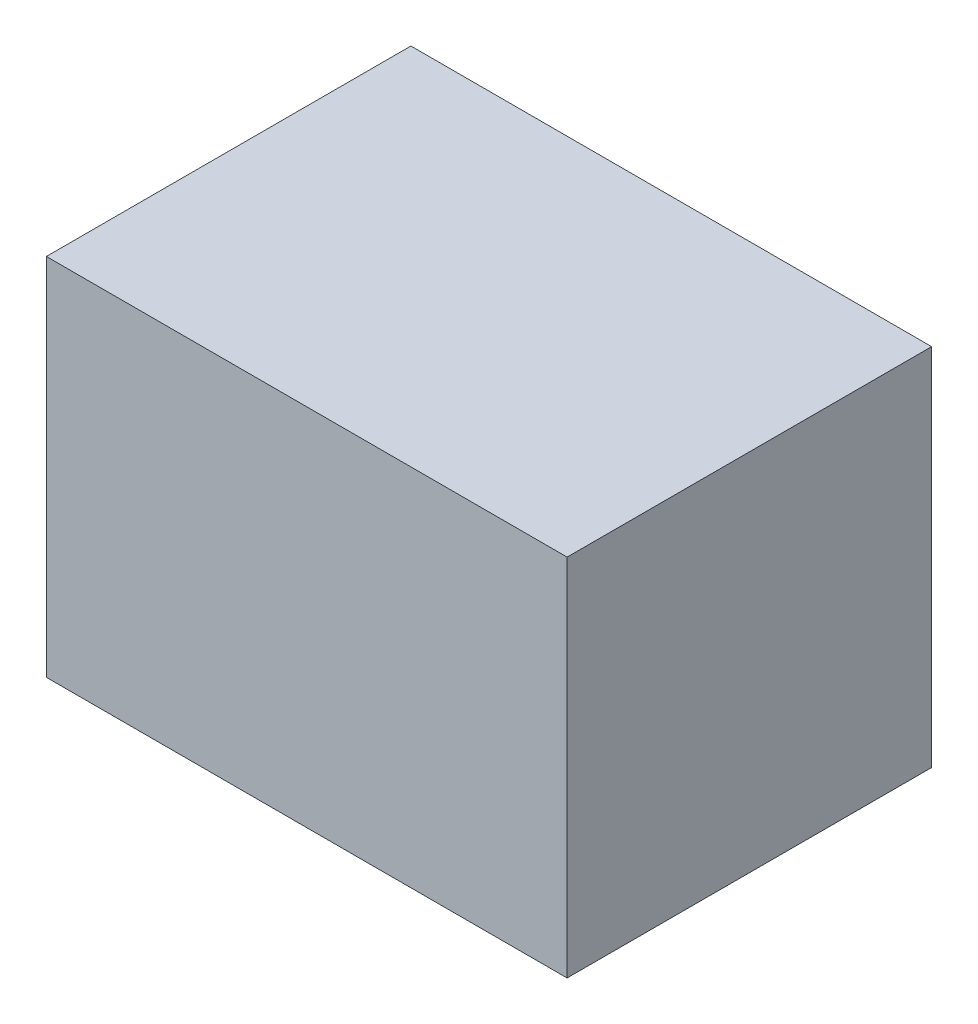
ISO-10303-21;
HEADER;
FILE_DESCRIPTION(('STEP AP214'),'2;1');
FILE_NAME('part.step','',(''),(''),'','','');
FILE_SCHEMA(('AUTOMOTIVE_DESIGN { 1 0 10303 214 1 1 1 1 }'));
ENDSEC;
DATA;
#1=APPLICATION_CONTEXT('core data for automotive mechanical design processes');
#2=APPLICATION_PROTOCOL_DEFINITION('international standard','automotive_design',2000,#1);
#3=PRODUCT_CONTEXT('',#1,'mechanical');
#4=PRODUCT('Part','Part','',(#3));
#5=PRODUCT_RELATED_PRODUCT_CATEGORY('part','',(#4));
#6=PRODUCT_DEFINITION_FORMATION('','',#4);
#7=PRODUCT_DEFINITION_CONTEXT('part definition',#1,'design');
#8=PRODUCT_DEFINITION('design','',#6,#7);
#9=PRODUCT_DEFINITION_SHAPE('','',#8);
#10=(LENGTH_UNIT() NAMED_UNIT(*) SI_UNIT(.MILLI.,.METRE.));
#11=(NAMED_UNIT(*) PLANE_ANGLE_UNIT() SI_UNIT($,.RADIAN.));
#12=(NAMED_UNIT(*) SI_UNIT($,.STERADIAN.) SOLID_ANGLE_UNIT());
#13=UNCERTAINTY_MEASURE_WITH_UNIT(LENGTH_MEASURE(1.E-05),#10,'distance_accuracy_value','');
#14=(GEOMETRIC_REPRESENTATION_CONTEXT(3) GLOBAL_UNCERTAINTY_ASSIGNED_CONTEXT((#13)) GLOBAL_UNIT_ASSIGNED_CONTEXT((#10,
#11,#12)) REPRESENTATION_CONTEXT('',''));
#15=CARTESIAN_POINT('',(0.,0.,0.));
#16=DIRECTION('',(0.,0.,1.));
#17=DIRECTION('',(1.,0.,0.));
#18=AXIS2_PLACEMENT_3D('',#15,#16,#17);
#19=CARTESIAN_POINT('',(-15.24,0.,0.));
#20=DIRECTION('',(0.,-1.,0.));
#21=DIRECTION('',(0.,0.,-1.));
#22=AXIS2_PLACEMENT_3D('',#19,#20,#21);
#23=PLANE('',#22);
#24=DIRECTION('',(1.,0.,0.));
#25=VECTOR('',#24,1.);
#26=CARTESIAN_POINT('',(-15.24,0.,-1.1));
#27=LINE('',#26,#25);
#28=CARTESIAN_POINT('',(-0.25,0.,-1.1));
#29=VERTEX_POINT('',#28);
#30=CARTESIAN_POINT('',(0.25,0.,-1.1));
#31=VERTEX_POINT('',#30);
#32=EDGE_CURVE('E96',#29,#31,#27,.T.);
#33=ORIENTED_EDGE('',*,*,#32,.F.);
#34=DIRECTION('',(0.,0.,1.));
#35=VECTOR('',#34,1.);
#36=CARTESIAN_POINT('',(-0.25,0.,0.));
#37=LINE('',#36,#35);
#38=CARTESIAN_POINT('',(-0.25,0.,-0.75));
#39=VERTEX_POINT('',#38);
#40=EDGE_CURVE('E27',#29,#39,#37,.T.);
#41=ORIENTED_EDGE('',*,*,#40,.T.);
#42=DIRECTION('',(1.,0.,0.));
#43=VECTOR('',#42,1.);
#44=CARTESIAN_POINT('',(-15.24,0.,-0.75));
#45=LINE('',#44,#43);
#46=CARTESIAN_POINT('',(0.25,0.,-0.75));
#47=VERTEX_POINT('',#46);
#48=EDGE_CURVE('E86',#39,#47,#45,.T.);
#49=ORIENTED_EDGE('',*,*,#48,.T.);
#50=DIRECTION('',(0.,0.,1.));
#51=VECTOR('',#50,1.);
#52=CARTESIAN_POINT('',(0.25,0.,0.));
#53=LINE('',#52,#51);
#54=EDGE_CURVE('E107',#31,#47,#53,.T.);
#55=ORIENTED_EDGE('',*,*,#54,.F.);
#56=EDGE_LOOP('',(#33,#41,#49,#55));
#57=FACE_BOUND('',#56,.T.);
#58=ADVANCED_FACE('F17',(#57),#23,.F.);
#59=CARTESIAN_POINT('',(-15.24,-0.35,0.));
#60=DIRECTION('',(0.,-1.,0.));
#61=DIRECTION('',(0.,0.,-1.));
#62=AXIS2_PLACEMENT_3D('',#59,#60,#61);
#63=PLANE('',#62);
#64=DIRECTION('',(1.,0.,0.));
#65=VECTOR('',#64,1.);
#66=CARTESIAN_POINT('',(-15.24,-0.35,-1.1));
#67=LINE('',#66,#65);
#68=CARTESIAN_POINT('',(-0.25,-0.35,-1.1));
#69=VERTEX_POINT('',#68);
#70=CARTESIAN_POINT('',(0.25,-0.35,-1.1));
#71=VERTEX_POINT('',#70);
#72=EDGE_CURVE('E89',#69,#71,#67,.T.);
#73=ORIENTED_EDGE('',*,*,#72,.T.);
#74=DIRECTION('',(0.,0.,1.));
#75=VECTOR('',#74,1.);
#76=CARTESIAN_POINT('',(0.25,-0.35,0.));
#77=LINE('',#76,#75);
#78=CARTESIAN_POINT('',(0.25,-0.35,-0.75));
#79=VERTEX_POINT('',#78);
#80=EDGE_CURVE('E75',#71,#79,#77,.T.);
#81=ORIENTED_EDGE('',*,*,#80,.T.);
#82=DIRECTION('',(1.,0.,0.));
#83=VECTOR('',#82,1.);
#84=CARTESIAN_POINT('',(-15.24,-0.35,-0.75));
#85=LINE('',#84,#83);
#86=CARTESIAN_POINT('',(-0.25,-0.35,-0.75));
#87=VERTEX_POINT('',#86);
#88=EDGE_CURVE('E21',#87,#79,#85,.T.);
#89=ORIENTED_EDGE('',*,*,#88,.F.);
#90=DIRECTION('',(0.,0.,1.));
#91=VECTOR('',#90,1.);
#92=CARTESIAN_POINT('',(-0.25,-0.35,0.));
#93=LINE('',#92,#91);
#94=EDGE_CURVE('E11',#69,#87,#93,.T.);
#95=ORIENTED_EDGE('',*,*,#94,.F.);
#96=EDGE_LOOP('',(#73,#81,#89,#95));
#97=FACE_BOUND('',#96,.T.);
#98=ADVANCED_FACE('F90',(#97),#63,.T.);
#99=CARTESIAN_POINT('',(-0.25,-0.35,0.));
#100=DIRECTION('',(-1.,0.,0.));
#101=DIRECTION('',(0.,0.,1.));
#102=AXIS2_PLACEMENT_3D('',#99,#100,#101);
#103=PLANE('',#102);
#104=ORIENTED_EDGE('',*,*,#40,.F.);
#105=DIRECTION('',(0.,1.,0.));
#106=VECTOR('',#105,1.);
#107=CARTESIAN_POINT('',(-0.25,-0.35,-1.1));
#108=LINE('',#107,#106);
#109=EDGE_CURVE('E94',#69,#29,#108,.T.);
#110=ORIENTED_EDGE('',*,*,#109,.F.);
#111=ORIENTED_EDGE('',*,*,#94,.T.);
#112=DIRECTION('',(0.,1.,0.));
#113=VECTOR('',#112,1.);
#114=CARTESIAN_POINT('',(-0.25,-0.35,-0.75));
#115=LINE('',#114,#113);
#116=EDGE_CURVE('E113',#87,#39,#115,.T.);
#117=ORIENTED_EDGE('',*,*,#116,.T.);
#118=EDGE_LOOP('',(#104,#110,#111,#117));
#119=FACE_BOUND('',#118,.T.);
#120=ADVANCED_FACE('F138',(#119),#103,.T.);
#121=CARTESIAN_POINT('',(-15.24,-0.35,-0.75));
#122=DIRECTION('',(0.,0.,1.));
#123=DIRECTION('',(1.,0.,0.));
#124=AXIS2_PLACEMENT_3D('',#121,#122,#123);
#125=PLANE('',#124);
#126=ORIENTED_EDGE('',*,*,#48,.F.);
#127=ORIENTED_EDGE('',*,*,#116,.F.);
#128=ORIENTED_EDGE('',*,*,#88,.T.);
#129=DIRECTION('',(0.,1.,0.));
#130=VECTOR('',#129,1.);
#131=CARTESIAN_POINT('',(0.25,-0.35,-0.75));
#132=LINE('',#131,#130);
#133=EDGE_CURVE('E83',#79,#47,#132,.T.);
#134=ORIENTED_EDGE('',*,*,#133,.T.);
#135=EDGE_LOOP('',(#126,#127,#128,#134));
#136=FACE_BOUND('',#135,.T.);
#137=ADVANCED_FACE('F122',(#136),#125,.T.);
#138=CARTESIAN_POINT('',(0.25,-0.35,0.));
#139=DIRECTION('',(-1.,0.,0.));
#140=DIRECTION('',(0.,0.,1.));
#141=AXIS2_PLACEMENT_3D('',#138,#139,#140);
#142=PLANE('',#141);
#143=ORIENTED_EDGE('',*,*,#54,.T.);
#144=ORIENTED_EDGE('',*,*,#133,.F.);
#145=ORIENTED_EDGE('',*,*,#80,.F.);
#146=DIRECTION('',(0.,1.,0.));
#147=VECTOR('',#146,1.);
#148=CARTESIAN_POINT('',(0.25,-0.35,-1.1));
#149=LINE('',#148,#147);
#150=EDGE_CURVE('E80',#71,#31,#149,.T.);
#151=ORIENTED_EDGE('',*,*,#150,.T.);
#152=EDGE_LOOP('',(#143,#144,#145,#151));
#153=FACE_BOUND('',#152,.T.);
#154=ADVANCED_FACE('F78',(#153),#142,.F.);
#155=CARTESIAN_POINT('',(-15.24,-0.35,-1.1));
#156=DIRECTION('',(0.,0.,1.));
#157=DIRECTION('',(1.,0.,0.));
#158=AXIS2_PLACEMENT_3D('',#155,#156,#157);
#159=PLANE('',#158);
#160=ORIENTED_EDGE('',*,*,#32,.T.);
#161=ORIENTED_EDGE('',*,*,#150,.F.);
#162=ORIENTED_EDGE('',*,*,#72,.F.);
#163=ORIENTED_EDGE('',*,*,#109,.T.);
#164=EDGE_LOOP('',(#160,#161,#162,#163));
#165=FACE_BOUND('',#164,.T.);
#166=ADVANCED_FACE('F19',(#165),#159,.F.);
#167=CLOSED_SHELL('',(#58,#98,#120,#137,#154,#166));
#168=MANIFOLD_SOLID_BREP('B1',#167);
#169=ADVANCED_BREP_SHAPE_REPRESENTATION('',(#18,#168),#14);
#170=SHAPE_DEFINITION_REPRESENTATION(#9,#169);
ENDSEC;
END-ISO-10303-21;
